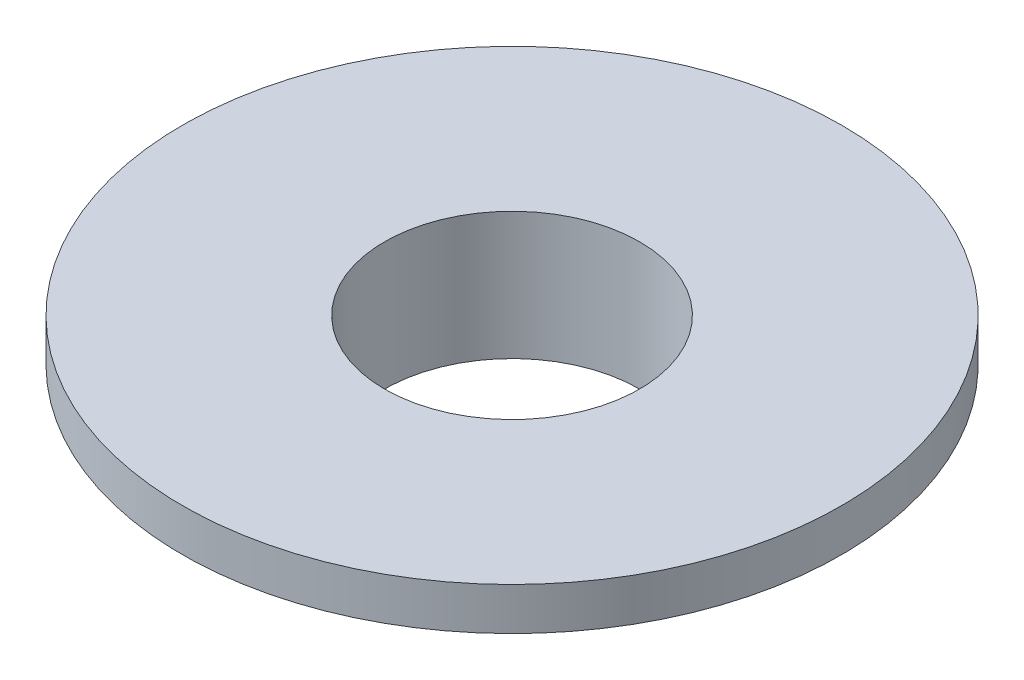
ISO-10303-21;
HEADER;
FILE_DESCRIPTION(('STEP AP214'),'2;1');
FILE_NAME('part.step','',(''),(''),'','','');
FILE_SCHEMA(('AUTOMOTIVE_DESIGN { 1 0 10303 214 1 1 1 1 }'));
ENDSEC;
DATA;
#1=APPLICATION_CONTEXT('core data for automotive mechanical design processes');
#2=APPLICATION_PROTOCOL_DEFINITION('international standard','automotive_design',2000,#1);
#3=PRODUCT_CONTEXT('',#1,'mechanical');
#4=PRODUCT('Part','Part','',(#3));
#5=PRODUCT_RELATED_PRODUCT_CATEGORY('part','',(#4));
#6=PRODUCT_DEFINITION_FORMATION('','',#4);
#7=PRODUCT_DEFINITION_CONTEXT('part definition',#1,'design');
#8=PRODUCT_DEFINITION('design','',#6,#7);
#9=PRODUCT_DEFINITION_SHAPE('','',#8);
#10=(LENGTH_UNIT() NAMED_UNIT(*) SI_UNIT(.MILLI.,.METRE.));
#11=(NAMED_UNIT(*) PLANE_ANGLE_UNIT() SI_UNIT($,.RADIAN.));
#12=(NAMED_UNIT(*) SI_UNIT($,.STERADIAN.) SOLID_ANGLE_UNIT());
#13=UNCERTAINTY_MEASURE_WITH_UNIT(LENGTH_MEASURE(1.E-05),#10,'distance_accuracy_value','');
#14=(GEOMETRIC_REPRESENTATION_CONTEXT(3) GLOBAL_UNCERTAINTY_ASSIGNED_CONTEXT((#13)) GLOBAL_UNIT_ASSIGNED_CONTEXT((#10,
#11,#12)) REPRESENTATION_CONTEXT('',''));
#15=CARTESIAN_POINT('',(0.,0.,0.));
#16=DIRECTION('',(0.,0.,1.));
#17=DIRECTION('',(1.,0.,0.));
#18=AXIS2_PLACEMENT_3D('',#15,#16,#17);
#19=CARTESIAN_POINT('',(6.7,0.,0.));
#20=DIRECTION('',(0.,-1.,0.));
#21=DIRECTION('',(0.,0.,-1.));
#22=AXIS2_PLACEMENT_3D('',#19,#20,#21);
#23=PLANE('',#22);
#24=CARTESIAN_POINT('',(0.,0.,0.));
#25=DIRECTION('',(0.,-1.,0.));
#26=DIRECTION('',(0.,0.,-1.));
#27=AXIS2_PLACEMENT_3D('',#24,#25,#26);
#28=CIRCLE('',#27,6.7);
#29=CARTESIAN_POINT('',(0.,0.,-6.7));
#30=VERTEX_POINT('',#29);
#31=EDGE_CURVE('E64',#30,#30,#28,.T.);
#32=ORIENTED_EDGE('',*,*,#31,.T.);
#33=EDGE_LOOP('',(#32));
#34=FACE_BOUND('',#33,.T.);
#35=CARTESIAN_POINT('',(0.,0.,0.));
#36=DIRECTION('',(0.,-1.,0.));
#37=DIRECTION('',(0.,0.,-1.));
#38=AXIS2_PLACEMENT_3D('',#35,#36,#37);
#39=CIRCLE('',#38,6.);
#40=CARTESIAN_POINT('',(0.,0.,-6.));
#41=VERTEX_POINT('',#40);
#42=EDGE_CURVE('E10',#41,#41,#39,.T.);
#43=ORIENTED_EDGE('',*,*,#42,.F.);
#44=EDGE_LOOP('',(#43));
#45=FACE_BOUND('',#44,.T.);
#46=ADVANCED_FACE('F37',(#34,#45),#23,.T.);
#47=CARTESIAN_POINT('',(0.,0.,0.));
#48=DIRECTION('',(0.,-1.,0.));
#49=DIRECTION('',(0.,0.,-1.));
#50=AXIS2_PLACEMENT_3D('',#47,#48,#49);
#51=CYLINDRICAL_SURFACE('',#50,6.);
#52=ORIENTED_EDGE('',*,*,#42,.T.);
#53=EDGE_LOOP('',(#52));
#54=FACE_BOUND('',#53,.T.);
#55=CARTESIAN_POINT('',(0.,6.,0.));
#56=DIRECTION('',(0.,-1.,0.));
#57=DIRECTION('',(0.,0.,-1.));
#58=AXIS2_PLACEMENT_3D('',#55,#56,#57);
#59=CIRCLE('',#58,6.);
#60=CARTESIAN_POINT('',(0.,6.,-6.));
#61=VERTEX_POINT('',#60);
#62=EDGE_CURVE('E44',#61,#61,#59,.T.);
#63=ORIENTED_EDGE('',*,*,#62,.F.);
#64=EDGE_LOOP('',(#63));
#65=FACE_BOUND('',#64,.T.);
#66=ADVANCED_FACE('F83',(#54,#65),#51,.F.);
#67=CARTESIAN_POINT('',(6.,6.,0.));
#68=DIRECTION('',(0.,1.,0.));
#69=DIRECTION('',(0.,0.,1.));
#70=AXIS2_PLACEMENT_3D('',#67,#68,#69);
#71=PLANE('',#70);
#72=ORIENTED_EDGE('',*,*,#62,.T.);
#73=EDGE_LOOP('',(#72));
#74=FACE_BOUND('',#73,.T.);
#75=CARTESIAN_POINT('',(0.,6.,0.));
#76=DIRECTION('',(0.,-1.,0.));
#77=DIRECTION('',(0.,0.,-1.));
#78=AXIS2_PLACEMENT_3D('',#75,#76,#77);
#79=CIRCLE('',#78,15.5);
#80=CARTESIAN_POINT('',(0.,6.,-15.5));
#81=VERTEX_POINT('',#80);
#82=EDGE_CURVE('E49',#81,#81,#79,.T.);
#83=ORIENTED_EDGE('',*,*,#82,.F.);
#84=EDGE_LOOP('',(#83));
#85=FACE_BOUND('',#84,.T.);
#86=ADVANCED_FACE('F87',(#74,#85),#71,.T.);
#87=CARTESIAN_POINT('',(0.,0.,0.));
#88=DIRECTION('',(0.,-1.,0.));
#89=DIRECTION('',(0.,0.,-1.));
#90=AXIS2_PLACEMENT_3D('',#87,#88,#89);
#91=CYLINDRICAL_SURFACE('',#90,15.5);
#92=ORIENTED_EDGE('',*,*,#82,.T.);
#93=EDGE_LOOP('',(#92));
#94=FACE_BOUND('',#93,.T.);
#95=CARTESIAN_POINT('',(0.,4.,0.));
#96=DIRECTION('',(0.,-1.,0.));
#97=DIRECTION('',(0.,0.,-1.));
#98=AXIS2_PLACEMENT_3D('',#95,#96,#97);
#99=CIRCLE('',#98,15.5);
#100=CARTESIAN_POINT('',(0.,4.,-15.5));
#101=VERTEX_POINT('',#100);
#102=EDGE_CURVE('E54',#101,#101,#99,.T.);
#103=ORIENTED_EDGE('',*,*,#102,.F.);
#104=EDGE_LOOP('',(#103));
#105=FACE_BOUND('',#104,.T.);
#106=ADVANCED_FACE('F79',(#94,#105),#91,.T.);
#107=CARTESIAN_POINT('',(15.5,4.,0.));
#108=DIRECTION('',(0.,-1.,0.));
#109=DIRECTION('',(0.,0.,-1.));
#110=AXIS2_PLACEMENT_3D('',#107,#108,#109);
#111=PLANE('',#110);
#112=ORIENTED_EDGE('',*,*,#102,.T.);
#113=EDGE_LOOP('',(#112));
#114=FACE_BOUND('',#113,.T.);
#115=CARTESIAN_POINT('',(0.,4.,0.));
#116=DIRECTION('',(0.,-1.,0.));
#117=DIRECTION('',(0.,0.,-1.));
#118=AXIS2_PLACEMENT_3D('',#115,#116,#117);
#119=CIRCLE('',#118,6.7);
#120=CARTESIAN_POINT('',(0.,4.,-6.7));
#121=VERTEX_POINT('',#120);
#122=EDGE_CURVE('E60',#121,#121,#119,.T.);
#123=ORIENTED_EDGE('',*,*,#122,.F.);
#124=EDGE_LOOP('',(#123));
#125=FACE_BOUND('',#124,.T.);
#126=ADVANCED_FACE('F73',(#114,#125),#111,.T.);
#127=CARTESIAN_POINT('',(0.,0.,0.));
#128=DIRECTION('',(0.,-1.,0.));
#129=DIRECTION('',(0.,0.,-1.));
#130=AXIS2_PLACEMENT_3D('',#127,#128,#129);
#131=CYLINDRICAL_SURFACE('',#130,6.7);
#132=ORIENTED_EDGE('',*,*,#122,.T.);
#133=EDGE_LOOP('',(#132));
#134=FACE_BOUND('',#133,.T.);
#135=ORIENTED_EDGE('',*,*,#31,.F.);
#136=EDGE_LOOP('',(#135));
#137=FACE_BOUND('',#136,.T.);
#138=ADVANCED_FACE('F71',(#134,#137),#131,.T.);
#139=CLOSED_SHELL('',(#46,#66,#86,#106,#126,#138));
#140=MANIFOLD_SOLID_BREP('B2',#139);
#141=ADVANCED_BREP_SHAPE_REPRESENTATION('',(#18,#140),#14);
#142=SHAPE_DEFINITION_REPRESENTATION(#9,#141);
ENDSEC;
END-ISO-10303-21;
